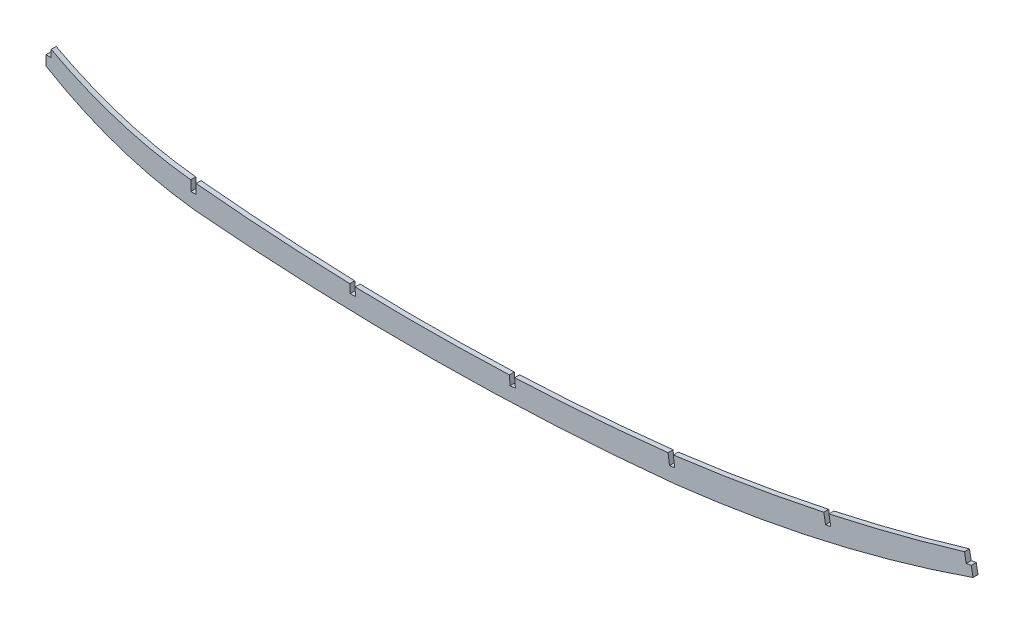
ISO-10303-21;
HEADER;
FILE_DESCRIPTION(('STEP AP214'),'2;1');
FILE_NAME('part.step','',(''),(''),'','','');
FILE_SCHEMA(('AUTOMOTIVE_DESIGN { 1 0 10303 214 1 1 1 1 }'));
ENDSEC;
DATA;
#1=APPLICATION_CONTEXT('core data for automotive mechanical design processes');
#2=APPLICATION_PROTOCOL_DEFINITION('international standard','automotive_design',2000,#1);
#3=PRODUCT_CONTEXT('',#1,'mechanical');
#4=PRODUCT('Part','Part','',(#3));
#5=PRODUCT_RELATED_PRODUCT_CATEGORY('part','',(#4));
#6=PRODUCT_DEFINITION_FORMATION('','',#4);
#7=PRODUCT_DEFINITION_CONTEXT('part definition',#1,'design');
#8=PRODUCT_DEFINITION('design','',#6,#7);
#9=PRODUCT_DEFINITION_SHAPE('','',#8);
#10=(LENGTH_UNIT() NAMED_UNIT(*) SI_UNIT(.MILLI.,.METRE.));
#11=(NAMED_UNIT(*) PLANE_ANGLE_UNIT() SI_UNIT($,.RADIAN.));
#12=(NAMED_UNIT(*) SI_UNIT($,.STERADIAN.) SOLID_ANGLE_UNIT());
#13=UNCERTAINTY_MEASURE_WITH_UNIT(LENGTH_MEASURE(1.E-05),#10,'distance_accuracy_value','');
#14=(GEOMETRIC_REPRESENTATION_CONTEXT(3) GLOBAL_UNCERTAINTY_ASSIGNED_CONTEXT((#13)) GLOBAL_UNIT_ASSIGNED_CONTEXT((#10,
#11,#12)) REPRESENTATION_CONTEXT('',''));
#15=CARTESIAN_POINT('',(0.,0.,0.));
#16=DIRECTION('',(0.,0.,1.));
#17=DIRECTION('',(1.,0.,0.));
#18=AXIS2_PLACEMENT_3D('',#15,#16,#17);
#19=CARTESIAN_POINT('',(254.672451197666,1031.92211819024,3.175));
#20=DIRECTION('',(0.,0.,-1.));
#21=DIRECTION('',(-1.,0.,0.));
#22=AXIS2_PLACEMENT_3D('',#19,#20,#21);
#23=CYLINDRICAL_SURFACE('',#22,1150.31332040319);
#24=DIRECTION('',(0.,0.,-1.));
#25=VECTOR('',#24,1.);
#26=CARTESIAN_POINT('',(495.714603883283,-92.8531552425034,3.175));
#27=LINE('',#26,#25);
#28=CARTESIAN_POINT('',(495.714603883283,-92.8531552425034,0.));
#29=VERTEX_POINT('',#28);
#30=CARTESIAN_POINT('',(495.714603883283,-92.8531552425034,3.175));
#31=VERTEX_POINT('',#30);
#32=EDGE_CURVE('E369',#29,#31,#27,.F.);
#33=ORIENTED_EDGE('',*,*,#32,.F.);
#34=CARTESIAN_POINT('',(254.672451197666,1031.92211819024,0.));
#35=DIRECTION('',(0.,0.,1.));
#36=DIRECTION('',(1.,0.,0.));
#37=AXIS2_PLACEMENT_3D('',#34,#35,#36);
#38=CIRCLE('',#37,1150.31332040319);
#39=CARTESIAN_POINT('',(399.839177363026,-109.194596572737,0.));
#40=VERTEX_POINT('',#39);
#41=EDGE_CURVE('E350',#40,#29,#38,.T.);
#42=ORIENTED_EDGE('',*,*,#41,.F.);
#43=DIRECTION('',(0.,0.,-1.));
#44=VECTOR('',#43,1.);
#45=CARTESIAN_POINT('',(399.839177363026,-109.194596572737,3.175));
#46=LINE('',#45,#44);
#47=CARTESIAN_POINT('',(399.839177363026,-109.194596572737,3.175));
#48=VERTEX_POINT('',#47);
#49=EDGE_CURVE('E367',#48,#40,#46,.T.);
#50=ORIENTED_EDGE('',*,*,#49,.F.);
#51=CARTESIAN_POINT('',(254.672451197666,1031.92211819024,3.175));
#52=DIRECTION('',(0.,0.,1.));
#53=DIRECTION('',(1.,0.,0.));
#54=AXIS2_PLACEMENT_3D('',#51,#52,#53);
#55=CIRCLE('',#54,1150.31332040319);
#56=EDGE_CURVE('E332',#48,#31,#55,.T.);
#57=ORIENTED_EDGE('',*,*,#56,.T.);
#58=EDGE_LOOP('',(#33,#42,#50,#57));
#59=FACE_BOUND('',#58,.T.);
#60=ADVANCED_FACE('F39',(#59),#23,.F.);
#61=CARTESIAN_POINT('',(237.35862434664,1321.37429175112,3.175));
#62=DIRECTION('',(0.,0.,-1.));
#63=DIRECTION('',(-1.,0.,0.));
#64=AXIS2_PLACEMENT_3D('',#61,#62,#63);
#65=CYLINDRICAL_SURFACE('',#64,1439.78857693711);
#66=DIRECTION('',(0.,0.,-1.));
#67=VECTOR('',#66,1.);
#68=CARTESIAN_POINT('',(95.6691,-111.425493623303,3.175));
#69=LINE('',#68,#67);
#70=CARTESIAN_POINT('',(95.6691,-111.425493623303,3.175));
#71=VERTEX_POINT('',#70);
#72=CARTESIAN_POINT('',(95.6691,-111.425493623303,0.));
#73=VERTEX_POINT('',#72);
#74=EDGE_CURVE('E317',#71,#73,#69,.T.);
#75=ORIENTED_EDGE('',*,*,#74,.F.);
#76=CARTESIAN_POINT('',(237.35862434664,1321.37429175112,3.175));
#77=DIRECTION('',(0.,0.,1.));
#78=DIRECTION('',(1.,0.,0.));
#79=AXIS2_PLACEMENT_3D('',#76,#77,#78);
#80=CIRCLE('',#79,1439.78857693711);
#81=CARTESIAN_POINT('',(193.623485077633,-117.749880748144,3.175));
#82=VERTEX_POINT('',#81);
#83=EDGE_CURVE('E316',#71,#82,#80,.T.);
#84=ORIENTED_EDGE('',*,*,#83,.T.);
#85=DIRECTION('',(0.,0.,-1.));
#86=VECTOR('',#85,1.);
#87=CARTESIAN_POINT('',(193.623485077633,-117.749880748144,3.175));
#88=LINE('',#87,#86);
#89=CARTESIAN_POINT('',(193.623485077633,-117.749880748144,0.));
#90=VERTEX_POINT('',#89);
#91=EDGE_CURVE('E307',#90,#82,#88,.F.);
#92=ORIENTED_EDGE('',*,*,#91,.F.);
#93=CARTESIAN_POINT('',(237.35862434664,1321.37429175112,0.));
#94=DIRECTION('',(0.,0.,1.));
#95=DIRECTION('',(1.,0.,0.));
#96=AXIS2_PLACEMENT_3D('',#93,#94,#95);
#97=CIRCLE('',#96,1439.78857693711);
#98=EDGE_CURVE('E263',#73,#90,#97,.T.);
#99=ORIENTED_EDGE('',*,*,#98,.F.);
#100=EDGE_LOOP('',(#75,#84,#92,#99));
#101=FACE_BOUND('',#100,.T.);
#102=ADVANCED_FACE('F314',(#101),#65,.F.);
#103=DIRECTION('',(0.,0.,-1.));
#104=VECTOR('',#103,1.);
#105=CARTESIAN_POINT('',(197.008785596879,-117.848775320638,3.175));
#106=LINE('',#105,#104);
#107=CARTESIAN_POINT('',(197.008785596879,-117.848775320638,3.175));
#108=VERTEX_POINT('',#107);
#109=CARTESIAN_POINT('',(197.008785596879,-117.848775320638,0.));
#110=VERTEX_POINT('',#109);
#111=EDGE_CURVE('E318',#108,#110,#106,.T.);
#112=ORIENTED_EDGE('',*,*,#111,.F.);
#113=CARTESIAN_POINT('',(295.327290668786,-117.24684670174,3.175));
#114=VERTEX_POINT('',#113);
#115=EDGE_CURVE('E336',#108,#114,#80,.T.);
#116=ORIENTED_EDGE('',*,*,#115,.T.);
#117=DIRECTION('',(0.,0.,-1.));
#118=VECTOR('',#117,1.);
#119=CARTESIAN_POINT('',(295.327290668786,-117.24684670174,3.175));
#120=LINE('',#119,#118);
#121=CARTESIAN_POINT('',(295.327290668786,-117.24684670174,0.));
#122=VERTEX_POINT('',#121);
#123=EDGE_CURVE('E322',#122,#114,#120,.F.);
#124=ORIENTED_EDGE('',*,*,#123,.F.);
#125=EDGE_CURVE('E353',#110,#122,#97,.T.);
#126=ORIENTED_EDGE('',*,*,#125,.F.);
#127=EDGE_LOOP('',(#112,#116,#124,#126));
#128=FACE_BOUND('',#127,.T.);
#129=ADVANCED_FACE('F400',(#128),#65,.F.);
#130=DIRECTION('',(0.,0.,-1.));
#131=VECTOR('',#130,1.);
#132=CARTESIAN_POINT('',(499.018474642178,-92.1400490958373,3.175));
#133=LINE('',#132,#131);
#134=CARTESIAN_POINT('',(499.018474642178,-92.1400490958373,3.175));
#135=VERTEX_POINT('',#134);
#136=CARTESIAN_POINT('',(499.018474642178,-92.1400490958373,0.));
#137=VERTEX_POINT('',#136);
#138=EDGE_CURVE('E373',#135,#137,#133,.T.);
#139=ORIENTED_EDGE('',*,*,#138,.F.);
#140=CARTESIAN_POINT('',(585.429283383532,-69.8131735470224,3.175));
#141=VERTEX_POINT('',#140);
#142=EDGE_CURVE('E273',#135,#141,#55,.T.);
#143=ORIENTED_EDGE('',*,*,#142,.T.);
#144=DIRECTION('',(0.,0.,-1.));
#145=VECTOR('',#144,1.);
#146=CARTESIAN_POINT('',(585.429283383532,-69.8131735470222,3.175));
#147=LINE('',#146,#145);
#148=CARTESIAN_POINT('',(585.429283383532,-69.8131735470224,0.));
#149=VERTEX_POINT('',#148);
#150=EDGE_CURVE('E376',#149,#141,#147,.F.);
#151=ORIENTED_EDGE('',*,*,#150,.F.);
#152=EDGE_CURVE('E329',#137,#149,#38,.T.);
#153=ORIENTED_EDGE('',*,*,#152,.F.);
#154=EDGE_LOOP('',(#139,#143,#151,#153));
#155=FACE_BOUND('',#154,.T.);
#156=ADVANCED_FACE('F41',(#155),#23,.F.);
#157=DIRECTION('',(0.,0.,-1.));
#158=VECTOR('',#157,1.);
#159=CARTESIAN_POINT('',(298.705922287425,-117.106731868565,3.175));
#160=LINE('',#159,#158);
#161=CARTESIAN_POINT('',(298.705922287425,-117.106731868565,3.175));
#162=VERTEX_POINT('',#161);
#163=CARTESIAN_POINT('',(298.705922287425,-117.106731868565,0.));
#164=VERTEX_POINT('',#163);
#165=EDGE_CURVE('E372',#162,#164,#160,.T.);
#166=ORIENTED_EDGE('',*,*,#165,.F.);
#167=CARTESIAN_POINT('',(396.484353389184,-109.593963883941,3.175));
#168=VERTEX_POINT('',#167);
#169=EDGE_CURVE('E333',#162,#168,#80,.T.);
#170=ORIENTED_EDGE('',*,*,#169,.T.);
#171=DIRECTION('',(0.,0.,-1.));
#172=VECTOR('',#171,1.);
#173=CARTESIAN_POINT('',(396.484353389184,-109.593963883941,3.175));
#174=LINE('',#173,#172);
#175=CARTESIAN_POINT('',(396.484353389184,-109.593963883941,0.));
#176=VERTEX_POINT('',#175);
#177=EDGE_CURVE('E468',#176,#168,#174,.F.);
#178=ORIENTED_EDGE('',*,*,#177,.F.);
#179=EDGE_CURVE('E351',#164,#176,#97,.T.);
#180=ORIENTED_EDGE('',*,*,#179,.F.);
#181=EDGE_LOOP('',(#166,#170,#178,#180));
#182=FACE_BOUND('',#181,.T.);
#183=ADVANCED_FACE('F507',(#182),#65,.F.);
#184=CARTESIAN_POINT('',(118.154365108344,130.291543645457,3.175));
#185=DIRECTION('',(0.,0.,-1.));
#186=DIRECTION('',(-1.,0.,0.));
#187=AXIS2_PLACEMENT_3D('',#184,#185,#186);
#188=CYLINDRICAL_SURFACE('',#187,242.755675026931);
#189=DIRECTION('',(0.,0.,-1.));
#190=VECTOR('',#189,1.);
#191=CARTESIAN_POINT('',(3.30200000000001,-83.5758264389031,3.175));
#192=LINE('',#191,#190);
#193=CARTESIAN_POINT('',(3.30200000000001,-83.5758264389031,3.175));
#194=VERTEX_POINT('',#193);
#195=CARTESIAN_POINT('',(3.30200000000001,-83.5758264389031,0.));
#196=VERTEX_POINT('',#195);
#197=EDGE_CURVE('E327',#194,#196,#192,.T.);
#198=ORIENTED_EDGE('',*,*,#197,.F.);
#199=CARTESIAN_POINT('',(118.154365108344,130.291543645457,3.175));
#200=DIRECTION('',(0.,0.,1.));
#201=DIRECTION('',(1.,0.,0.));
#202=AXIS2_PLACEMENT_3D('',#199,#200,#201);
#203=CIRCLE('',#202,242.755675026931);
#204=CARTESIAN_POINT('',(92.2909,-111.082437823902,3.175));
#205=VERTEX_POINT('',#204);
#206=EDGE_CURVE('E337',#194,#205,#203,.T.);
#207=ORIENTED_EDGE('',*,*,#206,.T.);
#208=DIRECTION('',(0.,0.,-1.));
#209=VECTOR('',#208,1.);
#210=CARTESIAN_POINT('',(92.2909,-111.082437823902,3.175));
#211=LINE('',#210,#209);
#212=CARTESIAN_POINT('',(92.2909,-111.082437823902,0.));
#213=VERTEX_POINT('',#212);
#214=EDGE_CURVE('E320',#213,#205,#211,.F.);
#215=ORIENTED_EDGE('',*,*,#214,.F.);
#216=CARTESIAN_POINT('',(118.154365108344,130.291543645457,0.));
#217=DIRECTION('',(0.,0.,1.));
#218=DIRECTION('',(1.,0.,0.));
#219=AXIS2_PLACEMENT_3D('',#216,#217,#218);
#220=CIRCLE('',#219,242.755675026931);
#221=EDGE_CURVE('E258',#196,#213,#220,.T.);
#222=ORIENTED_EDGE('',*,*,#221,.F.);
#223=EDGE_LOOP('',(#198,#207,#215,#222));
#224=FACE_BOUND('',#223,.T.);
#225=ADVANCED_FACE('F513',(#224),#188,.F.);
#226=CARTESIAN_POINT('',(0.,0.,3.175));
#227=DIRECTION('',(-1.,0.,0.));
#228=DIRECTION('',(0.,0.,1.));
#229=AXIS2_PLACEMENT_3D('',#226,#227,#228);
#230=PLANE('',#229);
#231=DIRECTION('',(0.,0.,1.));
#232=VECTOR('',#231,1.);
#233=CARTESIAN_POINT('',(0.,-88.1812715032451,0.));
#234=LINE('',#233,#232);
#235=CARTESIAN_POINT('',(0.,-88.1812715032451,0.));
#236=VERTEX_POINT('',#235);
#237=CARTESIAN_POINT('',(0.,-88.1812715032451,3.175));
#238=VERTEX_POINT('',#237);
#239=EDGE_CURVE('E239',#236,#238,#234,.T.);
#240=ORIENTED_EDGE('',*,*,#239,.F.);
#241=DIRECTION('',(0.,1.,0.));
#242=VECTOR('',#241,1.);
#243=CARTESIAN_POINT('',(0.,0.,0.));
#244=LINE('',#243,#242);
#245=CARTESIAN_POINT('',(0.,-94.4694470237963,0.));
#246=VERTEX_POINT('',#245);
#247=EDGE_CURVE('E250',#246,#236,#244,.T.);
#248=ORIENTED_EDGE('',*,*,#247,.F.);
#249=DIRECTION('',(0.,0.,-1.));
#250=VECTOR('',#249,1.);
#251=CARTESIAN_POINT('',(0.,-94.4694470237963,3.175));
#252=LINE('',#251,#250);
#253=CARTESIAN_POINT('',(0.,-94.4694470237963,3.175));
#254=VERTEX_POINT('',#253);
#255=EDGE_CURVE('E284',#254,#246,#252,.T.);
#256=ORIENTED_EDGE('',*,*,#255,.F.);
#257=DIRECTION('',(0.,1.,0.));
#258=VECTOR('',#257,1.);
#259=CARTESIAN_POINT('',(0.,0.,3.175));
#260=LINE('',#259,#258);
#261=EDGE_CURVE('E252',#254,#238,#260,.T.);
#262=ORIENTED_EDGE('',*,*,#261,.T.);
#263=EDGE_LOOP('',(#240,#248,#256,#262));
#264=FACE_BOUND('',#263,.T.);
#265=ADVANCED_FACE('F249',(#264),#230,.T.);
#266=CARTESIAN_POINT('',(121.734926149577,108.841104283008,3.175));
#267=DIRECTION('',(0.,0.,-1.));
#268=DIRECTION('',(-1.,0.,0.));
#269=AXIS2_PLACEMENT_3D('',#266,#267,#268);
#270=CYLINDRICAL_SURFACE('',#269,236.969560318028);
#271=CARTESIAN_POINT('',(121.734926149577,108.841104283008,0.));
#272=DIRECTION('',(0.,0.,1.));
#273=DIRECTION('',(1.,0.,0.));
#274=AXIS2_PLACEMENT_3D('',#271,#272,#273);
#275=CIRCLE('',#274,236.969560318028);
#276=CARTESIAN_POINT('',(93.9800000000004,-126.497453101351,0.));
#277=VERTEX_POINT('',#276);
#278=EDGE_CURVE('E257',#246,#277,#275,.T.);
#279=ORIENTED_EDGE('',*,*,#278,.T.);
#280=DIRECTION('',(0.,0.,-1.));
#281=VECTOR('',#280,1.);
#282=CARTESIAN_POINT('',(93.9800000000004,-126.497453101351,3.175));
#283=LINE('',#282,#281);
#284=CARTESIAN_POINT('',(93.9800000000004,-126.497453101351,3.175));
#285=VERTEX_POINT('',#284);
#286=EDGE_CURVE('E281',#285,#277,#283,.T.);
#287=ORIENTED_EDGE('',*,*,#286,.F.);
#288=CARTESIAN_POINT('',(121.734926149577,108.841104283008,3.175));
#289=DIRECTION('',(0.,0.,1.));
#290=DIRECTION('',(1.,0.,0.));
#291=AXIS2_PLACEMENT_3D('',#288,#289,#290);
#292=CIRCLE('',#291,236.969560318028);
#293=EDGE_CURVE('E341',#254,#285,#292,.T.);
#294=ORIENTED_EDGE('',*,*,#293,.F.);
#295=ORIENTED_EDGE('',*,*,#255,.T.);
#296=EDGE_LOOP('',(#279,#287,#294,#295));
#297=FACE_BOUND('',#296,.T.);
#298=ADVANCED_FACE('F523',(#297),#270,.T.);
#299=CARTESIAN_POINT('',(237.971630213688,1487.12434573409,3.175));
#300=DIRECTION('',(0.,0.,-1.));
#301=DIRECTION('',(-1.,0.,0.));
#302=AXIS2_PLACEMENT_3D('',#299,#300,#301);
#303=CYLINDRICAL_SURFACE('',#302,1620.03361053051);
#304=CARTESIAN_POINT('',(237.971630213688,1487.12434573409,0.));
#305=DIRECTION('',(0.,0.,1.));
#306=DIRECTION('',(1.,0.,0.));
#307=AXIS2_PLACEMENT_3D('',#304,#305,#306);
#308=CIRCLE('',#307,1620.03361053051);
#309=CARTESIAN_POINT('',(400.203586986722,-124.765753326672,0.));
#310=VERTEX_POINT('',#309);
#311=EDGE_CURVE('E260',#277,#310,#308,.T.);
#312=ORIENTED_EDGE('',*,*,#311,.T.);
#313=DIRECTION('',(0.,0.,-1.));
#314=VECTOR('',#313,1.);
#315=CARTESIAN_POINT('',(400.203586986722,-124.765753326672,3.175));
#316=LINE('',#315,#314);
#317=CARTESIAN_POINT('',(400.203586986722,-124.765753326672,3.175));
#318=VERTEX_POINT('',#317);
#319=EDGE_CURVE('E277',#318,#310,#316,.T.);
#320=ORIENTED_EDGE('',*,*,#319,.F.);
#321=CARTESIAN_POINT('',(237.971630213688,1487.12434573409,3.175));
#322=DIRECTION('',(0.,0.,1.));
#323=DIRECTION('',(1.,0.,0.));
#324=AXIS2_PLACEMENT_3D('',#321,#322,#323);
#325=CIRCLE('',#324,1620.03361053051);
#326=EDGE_CURVE('E343',#285,#318,#325,.T.);
#327=ORIENTED_EDGE('',*,*,#326,.F.);
#328=ORIENTED_EDGE('',*,*,#286,.T.);
#329=EDGE_LOOP('',(#312,#320,#327,#328));
#330=FACE_BOUND('',#329,.T.);
#331=ADVANCED_FACE('F526',(#330),#303,.T.);
#332=CARTESIAN_POINT('',(300.498350227972,753.512922358262,3.175));
#333=DIRECTION('',(0.,0.,-1.));
#334=DIRECTION('',(-1.,0.,0.));
#335=AXIS2_PLACEMENT_3D('',#332,#333,#334);
#336=CYLINDRICAL_SURFACE('',#335,883.92);
#337=CARTESIAN_POINT('',(300.498350227972,753.512922358262,0.));
#338=DIRECTION('',(0.,0.,1.));
#339=DIRECTION('',(1.,0.,0.));
#340=AXIS2_PLACEMENT_3D('',#337,#338,#339);
#341=CIRCLE('',#340,883.92);
#342=CARTESIAN_POINT('',(590.864339182333,-81.3536291687202,0.));
#343=VERTEX_POINT('',#342);
#344=EDGE_CURVE('E268',#310,#343,#341,.T.);
#345=ORIENTED_EDGE('',*,*,#344,.T.);
#346=DIRECTION('',(0.,0.,-1.));
#347=VECTOR('',#346,1.);
#348=CARTESIAN_POINT('',(590.864339182333,-81.3536291687202,3.175));
#349=LINE('',#348,#347);
#350=CARTESIAN_POINT('',(590.864339182333,-81.3536291687202,3.175));
#351=VERTEX_POINT('',#350);
#352=EDGE_CURVE('E274',#351,#343,#349,.T.);
#353=ORIENTED_EDGE('',*,*,#352,.F.);
#354=CARTESIAN_POINT('',(300.498350227972,753.512922358262,3.175));
#355=DIRECTION('',(0.,0.,1.));
#356=DIRECTION('',(1.,0.,0.));
#357=AXIS2_PLACEMENT_3D('',#354,#355,#356);
#358=CIRCLE('',#357,883.92);
#359=EDGE_CURVE('E345',#318,#351,#358,.T.);
#360=ORIENTED_EDGE('',*,*,#359,.F.);
#361=ORIENTED_EDGE('',*,*,#319,.T.);
#362=EDGE_LOOP('',(#345,#353,#360,#361));
#363=FACE_BOUND('',#362,.T.);
#364=ADVANCED_FACE('F530',(#363),#336,.T.);
#365=CARTESIAN_POINT('',(557.656434856401,101.355592915415,3.175));
#366=DIRECTION('',(-0.983881237780973,-0.178823124742247,0.));
#367=DIRECTION('',(0.178823124742247,-0.983881237780973,0.));
#368=AXIS2_PLACEMENT_3D('',#365,#366,#367);
#369=PLANE('',#368);
#370=DIRECTION('',(-0.178823124742247,0.983881237780973,0.));
#371=VECTOR('',#370,1.);
#372=CARTESIAN_POINT('',(557.656434856401,101.355592915415,0.));
#373=LINE('',#372,#371);
#374=CARTESIAN_POINT('',(589.742350018123,-75.1804673405135,0.));
#375=VERTEX_POINT('',#374);
#376=EDGE_CURVE('E270',#343,#375,#373,.T.);
#377=ORIENTED_EDGE('',*,*,#376,.T.);
#378=DIRECTION('',(0.,0.,1.));
#379=VECTOR('',#378,1.);
#380=CARTESIAN_POINT('',(589.742350018123,-75.1804673405136,3.175));
#381=LINE('',#380,#379);
#382=CARTESIAN_POINT('',(589.742350018123,-75.1804673405136,3.175));
#383=VERTEX_POINT('',#382);
#384=EDGE_CURVE('E470',#375,#383,#381,.T.);
#385=ORIENTED_EDGE('',*,*,#384,.T.);
#386=DIRECTION('',(-0.178823124742247,0.983881237780973,0.));
#387=VECTOR('',#386,1.);
#388=CARTESIAN_POINT('',(557.656434856401,101.355592915415,3.175));
#389=LINE('',#388,#387);
#390=EDGE_CURVE('E278',#351,#383,#389,.T.);
#391=ORIENTED_EDGE('',*,*,#390,.F.);
#392=ORIENTED_EDGE('',*,*,#352,.T.);
#393=EDGE_LOOP('',(#377,#385,#391,#392));
#394=FACE_BOUND('',#393,.T.);
#395=ADVANCED_FACE('F534',(#394),#369,.F.);
#396=CARTESIAN_POINT('',(0.,0.,3.175));
#397=DIRECTION('',(0.,0.,1.));
#398=DIRECTION('',(1.,0.,0.));
#399=AXIS2_PLACEMENT_3D('',#396,#397,#398);
#400=PLANE('',#399);
#401=DIRECTION('',(0.,1.,0.));
#402=VECTOR('',#401,1.);
#403=CARTESIAN_POINT('',(3.30200000000001,-80.8492532430665,3.175));
#404=LINE('',#403,#402);
#405=CARTESIAN_POINT('',(3.30200000000001,-88.1812715032451,3.175));
#406=VERTEX_POINT('',#405);
#407=EDGE_CURVE('E244',#406,#194,#404,.T.);
#408=ORIENTED_EDGE('',*,*,#407,.F.);
#409=DIRECTION('',(1.,0.,0.));
#410=VECTOR('',#409,1.);
#411=CARTESIAN_POINT('',(0.,-88.1812715032451,3.175));
#412=LINE('',#411,#410);
#413=EDGE_CURVE('E615',#238,#406,#412,.T.);
#414=ORIENTED_EDGE('',*,*,#413,.F.);
#415=ORIENTED_EDGE('',*,*,#261,.F.);
#416=ORIENTED_EDGE('',*,*,#293,.T.);
#417=ORIENTED_EDGE('',*,*,#326,.T.);
#418=ORIENTED_EDGE('',*,*,#359,.T.);
#419=ORIENTED_EDGE('',*,*,#390,.T.);
#420=DIRECTION('',(0.983777385928307,0.179393575515032,0.));
#421=VECTOR('',#420,1.);
#422=CARTESIAN_POINT('',(586.515324681227,-75.7689212140668,3.175));
#423=LINE('',#422,#421);
#424=CARTESIAN_POINT('',(586.515324681227,-75.7689212140668,3.175));
#425=VERTEX_POINT('',#424);
#426=EDGE_CURVE('E462',#425,#383,#423,.T.);
#427=ORIENTED_EDGE('',*,*,#426,.F.);
#428=DIRECTION('',(0.179393575515032,-0.983777385928307,0.));
#429=VECTOR('',#428,1.);
#430=CARTESIAN_POINT('',(586.515324681227,-75.7689212140668,3.175));
#431=LINE('',#430,#429);
#432=EDGE_CURVE('E449',#141,#425,#431,.T.);
#433=ORIENTED_EDGE('',*,*,#432,.F.);
#434=ORIENTED_EDGE('',*,*,#142,.F.);
#435=DIRECTION('',(-0.179393575490294,0.983777385932818,0.));
#436=VECTOR('',#435,1.);
#437=CARTESIAN_POINT('',(500.199190721791,-98.6149843055094,3.175));
#438=LINE('',#437,#436);
#439=CARTESIAN_POINT('',(500.199190721791,-98.6149843055094,3.175));
#440=VERTEX_POINT('',#439);
#441=EDGE_CURVE('E432',#440,#135,#438,.T.);
#442=ORIENTED_EDGE('',*,*,#441,.F.);
#443=DIRECTION('',(0.983777385932816,0.179393575490302,0.));
#444=VECTOR('',#443,1.);
#445=CARTESIAN_POINT('',(496.875793956633,-99.2210116822308,3.175));
#446=LINE('',#445,#444);
#447=CARTESIAN_POINT('',(496.875793956633,-99.2210116822308,3.175));
#448=VERTEX_POINT('',#447);
#449=EDGE_CURVE('E434',#448,#440,#446,.T.);
#450=ORIENTED_EDGE('',*,*,#449,.F.);
#451=DIRECTION('',(0.179393575490301,-0.983777385932816,0.));
#452=VECTOR('',#451,1.);
#453=CARTESIAN_POINT('',(496.875793956633,-99.2210116822308,3.175));
#454=LINE('',#453,#452);
#455=EDGE_CURVE('E438',#31,#448,#454,.T.);
#456=ORIENTED_EDGE('',*,*,#455,.F.);
#457=ORIENTED_EDGE('',*,*,#56,.F.);
#458=DIRECTION('',(-0.131675290135219,0.991292902207922,0.));
#459=VECTOR('',#458,1.);
#460=CARTESIAN_POINT('',(400.723885221412,-115.854954940995,3.175));
#461=LINE('',#460,#459);
#462=CARTESIAN_POINT('',(400.723885221412,-115.854954940995,3.175));
#463=VERTEX_POINT('',#462);
#464=EDGE_CURVE('E450',#463,#48,#461,.T.);
#465=ORIENTED_EDGE('',*,*,#464,.F.);
#466=DIRECTION('',(0.991292902207923,0.131675290135217,0.));
#467=VECTOR('',#466,1.);
#468=CARTESIAN_POINT('',(397.375099539173,-116.29978040613,3.175));
#469=LINE('',#468,#467);
#470=CARTESIAN_POINT('',(397.375099539173,-116.29978040613,3.175));
#471=VERTEX_POINT('',#470);
#472=EDGE_CURVE('E452',#471,#463,#469,.T.);
#473=ORIENTED_EDGE('',*,*,#472,.F.);
#474=DIRECTION('',(0.13167529013522,-0.991292902207922,0.));
#475=VECTOR('',#474,1.);
#476=CARTESIAN_POINT('',(397.375099539173,-116.29978040613,3.175));
#477=LINE('',#476,#475);
#478=EDGE_CURVE('E418',#168,#471,#477,.T.);
#479=ORIENTED_EDGE('',*,*,#478,.F.);
#480=ORIENTED_EDGE('',*,*,#169,.F.);
#481=DIRECTION('',(-0.0857626230360208,0.996315598839033,0.));
#482=VECTOR('',#481,1.);
#483=CARTESIAN_POINT('',(299.18903405841,-122.719104442721,3.175));
#484=LINE('',#483,#482);
#485=CARTESIAN_POINT('',(299.18903405841,-122.719104442721,3.175));
#486=VERTEX_POINT('',#485);
#487=EDGE_CURVE('E419',#486,#162,#484,.T.);
#488=ORIENTED_EDGE('',*,*,#487,.F.);
#489=DIRECTION('',(0.996315598839034,0.0857626230360193,0.));
#490=VECTOR('',#489,1.);
#491=CARTESIAN_POINT('',(295.823280702412,-123.008827735861,3.175));
#492=LINE('',#491,#490);
#493=CARTESIAN_POINT('',(295.823280702412,-123.008827735861,3.175));
#494=VERTEX_POINT('',#493);
#495=EDGE_CURVE('E396',#494,#486,#492,.T.);
#496=ORIENTED_EDGE('',*,*,#495,.F.);
#497=DIRECTION('',(0.085762623036021,-0.996315598839033,0.));
#498=VECTOR('',#497,1.);
#499=CARTESIAN_POINT('',(295.823280702412,-123.008827735861,3.175));
#500=LINE('',#499,#498);
#501=EDGE_CURVE('E383',#114,#494,#500,.T.);
#502=ORIENTED_EDGE('',*,*,#501,.F.);
#503=ORIENTED_EDGE('',*,*,#115,.F.);
#504=DIRECTION('',(-0.0418331153502416,0.99912461207804,0.));
#505=VECTOR('',#504,1.);
#506=CARTESIAN_POINT('',(197.224876239004,-123.009793742993,3.175));
#507=LINE('',#506,#505);
#508=CARTESIAN_POINT('',(197.224876239004,-123.009793742993,3.175));
#509=VERTEX_POINT('',#508);
#510=EDGE_CURVE('E405',#509,#108,#507,.T.);
#511=ORIENTED_EDGE('',*,*,#510,.F.);
#512=DIRECTION('',(0.99912461207804,0.0418331153502432,0.));
#513=VECTOR('',#512,1.);
#514=CARTESIAN_POINT('',(193.849633474482,-123.151114373269,3.175));
#515=LINE('',#514,#513);
#516=CARTESIAN_POINT('',(193.849633474482,-123.151114373269,3.175));
#517=VERTEX_POINT('',#516);
#518=EDGE_CURVE('E603',#517,#509,#515,.T.);
#519=ORIENTED_EDGE('',*,*,#518,.F.);
#520=DIRECTION('',(0.0418331153502455,-0.99912461207804,0.));
#521=VECTOR('',#520,1.);
#522=CARTESIAN_POINT('',(193.849633474482,-123.151114373269,3.175));
#523=LINE('',#522,#521);
#524=EDGE_CURVE('E410',#82,#517,#523,.T.);
#525=ORIENTED_EDGE('',*,*,#524,.F.);
#526=ORIENTED_EDGE('',*,*,#83,.F.);
#527=DIRECTION('',(0.,1.,0.));
#528=VECTOR('',#527,1.);
#529=CARTESIAN_POINT('',(95.6691,-117.531253116271,3.175));
#530=LINE('',#529,#528);
#531=CARTESIAN_POINT('',(95.6691,-117.531253116271,3.175));
#532=VERTEX_POINT('',#531);
#533=EDGE_CURVE('E610',#532,#71,#530,.T.);
#534=ORIENTED_EDGE('',*,*,#533,.F.);
#535=DIRECTION('',(1.,0.,0.));
#536=VECTOR('',#535,1.);
#537=CARTESIAN_POINT('',(92.2909,-117.531253116271,3.175));
#538=LINE('',#537,#536);
#539=CARTESIAN_POINT('',(92.2909,-117.531253116271,3.175));
#540=VERTEX_POINT('',#539);
#541=EDGE_CURVE('E616',#540,#532,#538,.T.);
#542=ORIENTED_EDGE('',*,*,#541,.F.);
#543=DIRECTION('',(0.,-1.,0.));
#544=VECTOR('',#543,1.);
#545=CARTESIAN_POINT('',(92.2909,-117.531253116271,3.175));
#546=LINE('',#545,#544);
#547=EDGE_CURVE('E613',#205,#540,#546,.T.);
#548=ORIENTED_EDGE('',*,*,#547,.F.);
#549=ORIENTED_EDGE('',*,*,#206,.F.);
#550=EDGE_LOOP('',(#408,#414,#415,#416,#417,#418,#419,#427,#433,#434,#442,#450,#456,#457,#465,
#473,#479,#480,#488,#496,#502,#503,#511,#519,#525,#526,#534,#542,#548,#549));
#551=FACE_BOUND('',#550,.T.);
#552=ADVANCED_FACE('F392',(#551),#400,.T.);
#553=CARTESIAN_POINT('',(0.,0.,0.));
#554=DIRECTION('',(0.,0.,1.));
#555=DIRECTION('',(1.,0.,0.));
#556=AXIS2_PLACEMENT_3D('',#553,#554,#555);
#557=PLANE('',#556);
#558=DIRECTION('',(1.,0.,0.));
#559=VECTOR('',#558,1.);
#560=CARTESIAN_POINT('',(0.,-88.1812715032451,0.));
#561=LINE('',#560,#559);
#562=CARTESIAN_POINT('',(3.30200000000001,-88.1812715032451,0.));
#563=VERTEX_POINT('',#562);
#564=EDGE_CURVE('E235',#236,#563,#561,.T.);
#565=ORIENTED_EDGE('',*,*,#564,.T.);
#566=DIRECTION('',(0.,1.,0.));
#567=VECTOR('',#566,1.);
#568=CARTESIAN_POINT('',(3.30200000000001,-81.8236515032451,0.));
#569=LINE('',#568,#567);
#570=EDGE_CURVE('E54',#563,#196,#569,.T.);
#571=ORIENTED_EDGE('',*,*,#570,.T.);
#572=ORIENTED_EDGE('',*,*,#221,.T.);
#573=DIRECTION('',(0.,-1.,0.));
#574=VECTOR('',#573,1.);
#575=CARTESIAN_POINT('',(92.2909,0.,0.));
#576=LINE('',#575,#574);
#577=CARTESIAN_POINT('',(92.2909,-117.531253116271,0.));
#578=VERTEX_POINT('',#577);
#579=EDGE_CURVE('E11',#213,#578,#576,.T.);
#580=ORIENTED_EDGE('',*,*,#579,.T.);
#581=DIRECTION('',(1.,0.,0.));
#582=VECTOR('',#581,1.);
#583=CARTESIAN_POINT('',(92.2909,-117.531253116271,0.));
#584=LINE('',#583,#582);
#585=CARTESIAN_POINT('',(95.6691,-117.531253116271,0.));
#586=VERTEX_POINT('',#585);
#587=EDGE_CURVE('E607',#578,#586,#584,.T.);
#588=ORIENTED_EDGE('',*,*,#587,.T.);
#589=DIRECTION('',(0.,1.,0.));
#590=VECTOR('',#589,1.);
#591=CARTESIAN_POINT('',(95.6691,-117.531253116271,0.));
#592=LINE('',#591,#590);
#593=EDGE_CURVE('E62',#586,#73,#592,.T.);
#594=ORIENTED_EDGE('',*,*,#593,.T.);
#595=ORIENTED_EDGE('',*,*,#98,.T.);
#596=DIRECTION('',(0.0418331153502455,-0.99912461207804,0.));
#597=VECTOR('',#596,1.);
#598=CARTESIAN_POINT('',(188.363109812427,7.88671963963063,0.));
#599=LINE('',#598,#597);
#600=CARTESIAN_POINT('',(193.849633474482,-123.151114373269,0.));
#601=VERTEX_POINT('',#600);
#602=EDGE_CURVE('E47',#90,#601,#599,.T.);
#603=ORIENTED_EDGE('',*,*,#602,.T.);
#604=DIRECTION('',(0.99912461207804,0.0418331153502432,0.));
#605=VECTOR('',#604,1.);
#606=CARTESIAN_POINT('',(193.849633474482,-123.151114373269,0.));
#607=LINE('',#606,#605);
#608=CARTESIAN_POINT('',(197.224876239004,-123.009793742993,0.));
#609=VERTEX_POINT('',#608);
#610=EDGE_CURVE('E302',#601,#609,#607,.T.);
#611=ORIENTED_EDGE('',*,*,#610,.T.);
#612=DIRECTION('',(-0.0418331153502416,0.99912461207804,0.));
#613=VECTOR('',#612,1.);
#614=CARTESIAN_POINT('',(197.224876239004,-123.009793742993,0.));
#615=LINE('',#614,#613);
#616=EDGE_CURVE('E403',#609,#110,#615,.T.);
#617=ORIENTED_EDGE('',*,*,#616,.T.);
#618=ORIENTED_EDGE('',*,*,#125,.T.);
#619=DIRECTION('',(0.085762623036021,-0.996315598839033,0.));
#620=VECTOR('',#619,1.);
#621=CARTESIAN_POINT('',(283.136742256964,24.3723471981433,0.));
#622=LINE('',#621,#620);
#623=CARTESIAN_POINT('',(295.823280702412,-123.008827735861,0.));
#624=VERTEX_POINT('',#623);
#625=EDGE_CURVE('E295',#122,#624,#622,.T.);
#626=ORIENTED_EDGE('',*,*,#625,.T.);
#627=DIRECTION('',(0.996315598839034,0.0857626230360193,0.));
#628=VECTOR('',#627,1.);
#629=CARTESIAN_POINT('',(295.823280702412,-123.008827735861,0.));
#630=LINE('',#629,#628);
#631=CARTESIAN_POINT('',(299.18903405841,-122.719104442721,0.));
#632=VERTEX_POINT('',#631);
#633=EDGE_CURVE('E421',#624,#632,#630,.T.);
#634=ORIENTED_EDGE('',*,*,#633,.T.);
#635=DIRECTION('',(-0.0857626230360208,0.996315598839033,0.));
#636=VECTOR('',#635,1.);
#637=CARTESIAN_POINT('',(299.18903405841,-122.719104442721,0.));
#638=LINE('',#637,#636);
#639=EDGE_CURVE('E415',#632,#164,#638,.T.);
#640=ORIENTED_EDGE('',*,*,#639,.T.);
#641=ORIENTED_EDGE('',*,*,#179,.T.);
#642=DIRECTION('',(0.13167529013522,-0.991292902207923,0.));
#643=VECTOR('',#642,1.);
#644=CARTESIAN_POINT('',(375.304789743613,49.8524371238385,0.));
#645=LINE('',#644,#643);
#646=CARTESIAN_POINT('',(397.375099539173,-116.29978040613,0.));
#647=VERTEX_POINT('',#646);
#648=EDGE_CURVE('E286',#176,#647,#645,.T.);
#649=ORIENTED_EDGE('',*,*,#648,.T.);
#650=DIRECTION('',(0.991292902207923,0.131675290135217,0.));
#651=VECTOR('',#650,1.);
#652=CARTESIAN_POINT('',(397.375099539173,-116.29978040613,0.));
#653=LINE('',#652,#651);
#654=CARTESIAN_POINT('',(400.723885221412,-115.854954940995,0.));
#655=VERTEX_POINT('',#654);
#656=EDGE_CURVE('E453',#647,#655,#653,.T.);
#657=ORIENTED_EDGE('',*,*,#656,.T.);
#658=DIRECTION('',(-0.131675290135219,0.991292902207922,0.));
#659=VECTOR('',#658,1.);
#660=CARTESIAN_POINT('',(400.723885221412,-115.854954940995,0.));
#661=LINE('',#660,#659);
#662=EDGE_CURVE('E362',#655,#40,#661,.T.);
#663=ORIENTED_EDGE('',*,*,#662,.T.);
#664=ORIENTED_EDGE('',*,*,#41,.T.);
#665=DIRECTION('',(0.179393575490301,-0.983777385932816,0.));
#666=VECTOR('',#665,1.);
#667=CARTESIAN_POINT('',(463.374454050911,84.4971650006354,0.));
#668=LINE('',#667,#666);
#669=CARTESIAN_POINT('',(496.875793956633,-99.2210116822308,0.));
#670=VERTEX_POINT('',#669);
#671=EDGE_CURVE('E292',#29,#670,#668,.T.);
#672=ORIENTED_EDGE('',*,*,#671,.T.);
#673=DIRECTION('',(0.983777385932816,0.179393575490302,0.));
#674=VECTOR('',#673,1.);
#675=CARTESIAN_POINT('',(496.875793956633,-99.2210116822308,0.));
#676=LINE('',#675,#674);
#677=CARTESIAN_POINT('',(500.199190721791,-98.6149843055094,0.));
#678=VERTEX_POINT('',#677);
#679=EDGE_CURVE('E435',#670,#678,#676,.T.);
#680=ORIENTED_EDGE('',*,*,#679,.T.);
#681=DIRECTION('',(-0.179393575490294,0.983777385932818,0.));
#682=VECTOR('',#681,1.);
#683=CARTESIAN_POINT('',(500.199190721791,-98.6149843055094,0.));
#684=LINE('',#683,#682);
#685=EDGE_CURVE('E429',#678,#137,#684,.T.);
#686=ORIENTED_EDGE('',*,*,#685,.T.);
#687=ORIENTED_EDGE('',*,*,#152,.T.);
#688=DIRECTION('',(0.179393575515032,-0.983777385928307,0.));
#689=VECTOR('',#688,1.);
#690=CARTESIAN_POINT('',(554.268103787364,101.071785502089,0.));
#691=LINE('',#690,#689);
#692=CARTESIAN_POINT('',(586.515324681227,-75.7689212140668,0.));
#693=VERTEX_POINT('',#692);
#694=EDGE_CURVE('E289',#149,#693,#691,.T.);
#695=ORIENTED_EDGE('',*,*,#694,.T.);
#696=DIRECTION('',(0.983777385928307,0.179393575515032,0.));
#697=VECTOR('',#696,1.);
#698=CARTESIAN_POINT('',(586.515324681227,-75.7689212140668,0.));
#699=LINE('',#698,#697);
#700=EDGE_CURVE('E461',#693,#375,#699,.T.);
#701=ORIENTED_EDGE('',*,*,#700,.T.);
#702=ORIENTED_EDGE('',*,*,#376,.F.);
#703=ORIENTED_EDGE('',*,*,#344,.F.);
#704=ORIENTED_EDGE('',*,*,#311,.F.);
#705=ORIENTED_EDGE('',*,*,#278,.F.);
#706=ORIENTED_EDGE('',*,*,#247,.T.);
#707=EDGE_LOOP('',(#565,#571,#572,#580,#588,#594,#595,#603,#611,#617,#618,#626,#634,#640,#641,
#649,#657,#663,#664,#672,#680,#686,#687,#695,#701,#702,#703,#704,#705,#706));
#708=FACE_BOUND('',#707,.T.);
#709=ADVANCED_FACE('F255',(#708),#557,.F.);
#710=CARTESIAN_POINT('',(397.375099539173,-116.29978040613,0.));
#711=DIRECTION('',(-0.991292902207923,-0.13167529013522,0.));
#712=DIRECTION('',(0.13167529013522,-0.991292902207923,0.));
#713=AXIS2_PLACEMENT_3D('',#710,#711,#712);
#714=PLANE('',#713);
#715=ORIENTED_EDGE('',*,*,#177,.T.);
#716=ORIENTED_EDGE('',*,*,#478,.T.);
#717=DIRECTION('',(0.,0.,1.));
#718=VECTOR('',#717,1.);
#719=CARTESIAN_POINT('',(397.375099539173,-116.29978040613,0.));
#720=LINE('',#719,#718);
#721=EDGE_CURVE('E444',#647,#471,#720,.T.);
#722=ORIENTED_EDGE('',*,*,#721,.F.);
#723=ORIENTED_EDGE('',*,*,#648,.F.);
#724=EDGE_LOOP('',(#715,#716,#722,#723));
#725=FACE_BOUND('',#724,.T.);
#726=ADVANCED_FACE('F541',(#725),#714,.F.);
#727=CARTESIAN_POINT('',(400.723885221412,-115.854954940995,0.));
#728=DIRECTION('',(0.991292902207923,0.131675290135219,0.));
#729=DIRECTION('',(-0.131675290135219,0.991292902207923,0.));
#730=AXIS2_PLACEMENT_3D('',#727,#728,#729);
#731=PLANE('',#730);
#732=ORIENTED_EDGE('',*,*,#49,.T.);
#733=ORIENTED_EDGE('',*,*,#662,.F.);
#734=DIRECTION('',(0.,0.,1.));
#735=VECTOR('',#734,1.);
#736=CARTESIAN_POINT('',(400.723885221412,-115.854954940995,0.));
#737=LINE('',#736,#735);
#738=EDGE_CURVE('E447',#655,#463,#737,.T.);
#739=ORIENTED_EDGE('',*,*,#738,.T.);
#740=ORIENTED_EDGE('',*,*,#464,.T.);
#741=EDGE_LOOP('',(#732,#733,#739,#740));
#742=FACE_BOUND('',#741,.T.);
#743=ADVANCED_FACE('F548',(#742),#731,.F.);
#744=CARTESIAN_POINT('',(397.375099539173,-116.29978040613,0.));
#745=DIRECTION('',(0.131675290135217,-0.991292902207923,0.));
#746=DIRECTION('',(0.991292902207923,0.131675290135217,0.));
#747=AXIS2_PLACEMENT_3D('',#744,#745,#746);
#748=PLANE('',#747);
#749=ORIENTED_EDGE('',*,*,#472,.T.);
#750=ORIENTED_EDGE('',*,*,#738,.F.);
#751=ORIENTED_EDGE('',*,*,#656,.F.);
#752=ORIENTED_EDGE('',*,*,#721,.T.);
#753=EDGE_LOOP('',(#749,#750,#751,#752));
#754=FACE_BOUND('',#753,.T.);
#755=ADVANCED_FACE('F545',(#754),#748,.F.);
#756=CARTESIAN_POINT('',(586.515324681227,-75.7689212140668,0.));
#757=DIRECTION('',(0.179393575515032,-0.983777385928307,0.));
#758=DIRECTION('',(0.983777385928307,0.179393575515032,0.));
#759=AXIS2_PLACEMENT_3D('',#756,#757,#758);
#760=PLANE('',#759);
#761=ORIENTED_EDGE('',*,*,#700,.F.);
#762=DIRECTION('',(0.,0.,1.));
#763=VECTOR('',#762,1.);
#764=CARTESIAN_POINT('',(586.515324681227,-75.7689212140668,0.));
#765=LINE('',#764,#763);
#766=EDGE_CURVE('E440',#693,#425,#765,.T.);
#767=ORIENTED_EDGE('',*,*,#766,.T.);
#768=ORIENTED_EDGE('',*,*,#426,.T.);
#769=ORIENTED_EDGE('',*,*,#384,.F.);
#770=EDGE_LOOP('',(#761,#767,#768,#769));
#771=FACE_BOUND('',#770,.T.);
#772=ADVANCED_FACE('F498',(#771),#760,.F.);
#773=CARTESIAN_POINT('',(586.515324681227,-75.7689212140668,0.));
#774=DIRECTION('',(-0.983777385928307,-0.179393575515032,0.));
#775=DIRECTION('',(0.179393575515032,-0.983777385928307,0.));
#776=AXIS2_PLACEMENT_3D('',#773,#774,#775);
#777=PLANE('',#776);
#778=ORIENTED_EDGE('',*,*,#150,.T.);
#779=ORIENTED_EDGE('',*,*,#432,.T.);
#780=ORIENTED_EDGE('',*,*,#766,.F.);
#781=ORIENTED_EDGE('',*,*,#694,.F.);
#782=EDGE_LOOP('',(#778,#779,#780,#781));
#783=FACE_BOUND('',#782,.T.);
#784=ADVANCED_FACE('F475',(#783),#777,.F.);
#785=CARTESIAN_POINT('',(496.875793956633,-99.2210116822308,0.));
#786=DIRECTION('',(-0.983777385932816,-0.179393575490301,0.));
#787=DIRECTION('',(0.179393575490301,-0.983777385932816,0.));
#788=AXIS2_PLACEMENT_3D('',#785,#786,#787);
#789=PLANE('',#788);
#790=ORIENTED_EDGE('',*,*,#32,.T.);
#791=ORIENTED_EDGE('',*,*,#455,.T.);
#792=DIRECTION('',(0.,0.,1.));
#793=VECTOR('',#792,1.);
#794=CARTESIAN_POINT('',(496.875793956633,-99.2210116822308,0.));
#795=LINE('',#794,#793);
#796=EDGE_CURVE('E426',#670,#448,#795,.T.);
#797=ORIENTED_EDGE('',*,*,#796,.F.);
#798=ORIENTED_EDGE('',*,*,#671,.F.);
#799=EDGE_LOOP('',(#790,#791,#797,#798));
#800=FACE_BOUND('',#799,.T.);
#801=ADVANCED_FACE('F490',(#800),#789,.F.);
#802=CARTESIAN_POINT('',(500.199190721791,-98.6149843055094,0.));
#803=DIRECTION('',(0.983777385932818,0.179393575490294,0.));
#804=DIRECTION('',(-0.179393575490294,0.983777385932818,0.));
#805=AXIS2_PLACEMENT_3D('',#802,#803,#804);
#806=PLANE('',#805);
#807=ORIENTED_EDGE('',*,*,#138,.T.);
#808=ORIENTED_EDGE('',*,*,#685,.F.);
#809=DIRECTION('',(0.,0.,1.));
#810=VECTOR('',#809,1.);
#811=CARTESIAN_POINT('',(500.199190721791,-98.6149843055094,0.));
#812=LINE('',#811,#810);
#813=EDGE_CURVE('E430',#678,#440,#812,.T.);
#814=ORIENTED_EDGE('',*,*,#813,.T.);
#815=ORIENTED_EDGE('',*,*,#441,.T.);
#816=EDGE_LOOP('',(#807,#808,#814,#815));
#817=FACE_BOUND('',#816,.T.);
#818=ADVANCED_FACE('F483',(#817),#806,.F.);
#819=CARTESIAN_POINT('',(496.875793956633,-99.2210116822308,0.));
#820=DIRECTION('',(0.179393575490302,-0.983777385932816,0.));
#821=DIRECTION('',(0.983777385932816,0.179393575490302,0.));
#822=AXIS2_PLACEMENT_3D('',#819,#820,#821);
#823=PLANE('',#822);
#824=ORIENTED_EDGE('',*,*,#449,.T.);
#825=ORIENTED_EDGE('',*,*,#813,.F.);
#826=ORIENTED_EDGE('',*,*,#679,.F.);
#827=ORIENTED_EDGE('',*,*,#796,.T.);
#828=EDGE_LOOP('',(#824,#825,#826,#827));
#829=FACE_BOUND('',#828,.T.);
#830=ADVANCED_FACE('F487',(#829),#823,.F.);
#831=CARTESIAN_POINT('',(295.823280702412,-123.008827735861,0.));
#832=DIRECTION('',(-0.996315598839033,-0.085762623036021,0.));
#833=DIRECTION('',(0.085762623036021,-0.996315598839033,0.));
#834=AXIS2_PLACEMENT_3D('',#831,#832,#833);
#835=PLANE('',#834);
#836=ORIENTED_EDGE('',*,*,#123,.T.);
#837=ORIENTED_EDGE('',*,*,#501,.T.);
#838=DIRECTION('',(0.,0.,1.));
#839=VECTOR('',#838,1.);
#840=CARTESIAN_POINT('',(295.823280702412,-123.008827735861,0.));
#841=LINE('',#840,#839);
#842=EDGE_CURVE('E413',#624,#494,#841,.T.);
#843=ORIENTED_EDGE('',*,*,#842,.F.);
#844=ORIENTED_EDGE('',*,*,#625,.F.);
#845=EDGE_LOOP('',(#836,#837,#843,#844));
#846=FACE_BOUND('',#845,.T.);
#847=ADVANCED_FACE('F382',(#846),#835,.F.);
#848=CARTESIAN_POINT('',(299.18903405841,-122.719104442721,0.));
#849=DIRECTION('',(0.996315598839033,0.0857626230360208,0.));
#850=DIRECTION('',(-0.0857626230360208,0.996315598839033,0.));
#851=AXIS2_PLACEMENT_3D('',#848,#849,#850);
#852=PLANE('',#851);
#853=ORIENTED_EDGE('',*,*,#165,.T.);
#854=ORIENTED_EDGE('',*,*,#639,.F.);
#855=DIRECTION('',(0.,0.,1.));
#856=VECTOR('',#855,1.);
#857=CARTESIAN_POINT('',(299.18903405841,-122.719104442721,0.));
#858=LINE('',#857,#856);
#859=EDGE_CURVE('E416',#632,#486,#858,.T.);
#860=ORIENTED_EDGE('',*,*,#859,.T.);
#861=ORIENTED_EDGE('',*,*,#487,.T.);
#862=EDGE_LOOP('',(#853,#854,#860,#861));
#863=FACE_BOUND('',#862,.T.);
#864=ADVANCED_FACE('F561',(#863),#852,.F.);
#865=CARTESIAN_POINT('',(295.823280702412,-123.008827735861,0.));
#866=DIRECTION('',(0.0857626230360193,-0.996315598839033,0.));
#867=DIRECTION('',(0.996315598839034,0.0857626230360193,0.));
#868=AXIS2_PLACEMENT_3D('',#865,#866,#867);
#869=PLANE('',#868);
#870=ORIENTED_EDGE('',*,*,#495,.T.);
#871=ORIENTED_EDGE('',*,*,#859,.F.);
#872=ORIENTED_EDGE('',*,*,#633,.F.);
#873=ORIENTED_EDGE('',*,*,#842,.T.);
#874=EDGE_LOOP('',(#870,#871,#872,#873));
#875=FACE_BOUND('',#874,.T.);
#876=ADVANCED_FACE('F566',(#875),#869,.F.);
#877=CARTESIAN_POINT('',(193.849633474482,-123.151114373269,0.));
#878=DIRECTION('',(-0.99912461207804,-0.0418331153502455,0.));
#879=DIRECTION('',(0.0418331153502455,-0.99912461207804,0.));
#880=AXIS2_PLACEMENT_3D('',#877,#878,#879);
#881=PLANE('',#880);
#882=ORIENTED_EDGE('',*,*,#91,.T.);
#883=ORIENTED_EDGE('',*,*,#524,.T.);
#884=DIRECTION('',(0.,0.,1.));
#885=VECTOR('',#884,1.);
#886=CARTESIAN_POINT('',(193.849633474482,-123.151114373269,0.));
#887=LINE('',#886,#885);
#888=EDGE_CURVE('E310',#601,#517,#887,.T.);
#889=ORIENTED_EDGE('',*,*,#888,.F.);
#890=ORIENTED_EDGE('',*,*,#602,.F.);
#891=EDGE_LOOP('',(#882,#883,#889,#890));
#892=FACE_BOUND('',#891,.T.);
#893=ADVANCED_FACE('F306',(#892),#881,.F.);
#894=CARTESIAN_POINT('',(197.224876239004,-123.009793742993,0.));
#895=DIRECTION('',(0.99912461207804,0.0418331153502416,0.));
#896=DIRECTION('',(-0.0418331153502416,0.99912461207804,0.));
#897=AXIS2_PLACEMENT_3D('',#894,#895,#896);
#898=PLANE('',#897);
#899=ORIENTED_EDGE('',*,*,#111,.T.);
#900=ORIENTED_EDGE('',*,*,#616,.F.);
#901=DIRECTION('',(0.,0.,1.));
#902=VECTOR('',#901,1.);
#903=CARTESIAN_POINT('',(197.224876239004,-123.009793742993,0.));
#904=LINE('',#903,#902);
#905=EDGE_CURVE('E397',#609,#509,#904,.T.);
#906=ORIENTED_EDGE('',*,*,#905,.T.);
#907=ORIENTED_EDGE('',*,*,#510,.T.);
#908=EDGE_LOOP('',(#899,#900,#906,#907));
#909=FACE_BOUND('',#908,.T.);
#910=ADVANCED_FACE('F402',(#909),#898,.F.);
#911=CARTESIAN_POINT('',(193.849633474482,-123.151114373269,0.));
#912=DIRECTION('',(0.0418331153502432,-0.99912461207804,0.));
#913=DIRECTION('',(0.99912461207804,0.0418331153502432,0.));
#914=AXIS2_PLACEMENT_3D('',#911,#912,#913);
#915=PLANE('',#914);
#916=ORIENTED_EDGE('',*,*,#518,.T.);
#917=ORIENTED_EDGE('',*,*,#905,.F.);
#918=ORIENTED_EDGE('',*,*,#610,.F.);
#919=ORIENTED_EDGE('',*,*,#888,.T.);
#920=EDGE_LOOP('',(#916,#917,#918,#919));
#921=FACE_BOUND('',#920,.T.);
#922=ADVANCED_FACE('F589',(#921),#915,.F.);
#923=CARTESIAN_POINT('',(92.2909,-117.531253116271,0.));
#924=DIRECTION('',(-1.,0.,0.));
#925=DIRECTION('',(0.,0.,1.));
#926=AXIS2_PLACEMENT_3D('',#923,#924,#925);
#927=PLANE('',#926);
#928=ORIENTED_EDGE('',*,*,#214,.T.);
#929=ORIENTED_EDGE('',*,*,#547,.T.);
#930=DIRECTION('',(0.,0.,1.));
#931=VECTOR('',#930,1.);
#932=CARTESIAN_POINT('',(92.2909,-117.531253116271,0.));
#933=LINE('',#932,#931);
#934=EDGE_CURVE('E612',#578,#540,#933,.T.);
#935=ORIENTED_EDGE('',*,*,#934,.F.);
#936=ORIENTED_EDGE('',*,*,#579,.F.);
#937=EDGE_LOOP('',(#928,#929,#935,#936));
#938=FACE_BOUND('',#937,.T.);
#939=ADVANCED_FACE('F594',(#938),#927,.F.);
#940=CARTESIAN_POINT('',(95.6691,-117.531253116271,0.));
#941=DIRECTION('',(1.,0.,0.));
#942=DIRECTION('',(0.,0.,-1.));
#943=AXIS2_PLACEMENT_3D('',#940,#941,#942);
#944=PLANE('',#943);
#945=ORIENTED_EDGE('',*,*,#74,.T.);
#946=ORIENTED_EDGE('',*,*,#593,.F.);
#947=DIRECTION('',(0.,0.,1.));
#948=VECTOR('',#947,1.);
#949=CARTESIAN_POINT('',(95.6691,-117.531253116271,0.));
#950=LINE('',#949,#948);
#951=EDGE_CURVE('E620',#586,#532,#950,.T.);
#952=ORIENTED_EDGE('',*,*,#951,.T.);
#953=ORIENTED_EDGE('',*,*,#533,.T.);
#954=EDGE_LOOP('',(#945,#946,#952,#953));
#955=FACE_BOUND('',#954,.T.);
#956=ADVANCED_FACE('F591',(#955),#944,.F.);
#957=CARTESIAN_POINT('',(92.2909,-117.531253116271,0.));
#958=DIRECTION('',(0.,-1.,0.));
#959=DIRECTION('',(0.,0.,-1.));
#960=AXIS2_PLACEMENT_3D('',#957,#958,#959);
#961=PLANE('',#960);
#962=ORIENTED_EDGE('',*,*,#541,.T.);
#963=ORIENTED_EDGE('',*,*,#951,.F.);
#964=ORIENTED_EDGE('',*,*,#587,.F.);
#965=ORIENTED_EDGE('',*,*,#934,.T.);
#966=EDGE_LOOP('',(#962,#963,#964,#965));
#967=FACE_BOUND('',#966,.T.);
#968=ADVANCED_FACE('F635',(#967),#961,.F.);
#969=CARTESIAN_POINT('',(3.30200000000001,-80.8492532430665,0.));
#970=DIRECTION('',(1.,0.,0.));
#971=DIRECTION('',(0.,0.,-1.));
#972=AXIS2_PLACEMENT_3D('',#969,#970,#971);
#973=PLANE('',#972);
#974=ORIENTED_EDGE('',*,*,#197,.T.);
#975=ORIENTED_EDGE('',*,*,#570,.F.);
#976=DIRECTION('',(0.,0.,1.));
#977=VECTOR('',#976,1.);
#978=CARTESIAN_POINT('',(3.30200000000001,-88.1812715032451,0.));
#979=LINE('',#978,#977);
#980=EDGE_CURVE('E241',#563,#406,#979,.T.);
#981=ORIENTED_EDGE('',*,*,#980,.T.);
#982=ORIENTED_EDGE('',*,*,#407,.T.);
#983=EDGE_LOOP('',(#974,#975,#981,#982));
#984=FACE_BOUND('',#983,.T.);
#985=ADVANCED_FACE('F641',(#984),#973,.F.);
#986=CARTESIAN_POINT('',(0.,-88.1812715032451,0.));
#987=DIRECTION('',(0.,-1.,0.));
#988=DIRECTION('',(0.,0.,-1.));
#989=AXIS2_PLACEMENT_3D('',#986,#987,#988);
#990=PLANE('',#989);
#991=ORIENTED_EDGE('',*,*,#413,.T.);
#992=ORIENTED_EDGE('',*,*,#980,.F.);
#993=ORIENTED_EDGE('',*,*,#564,.F.);
#994=ORIENTED_EDGE('',*,*,#239,.T.);
#995=EDGE_LOOP('',(#991,#992,#993,#994));
#996=FACE_BOUND('',#995,.T.);
#997=ADVANCED_FACE('F238',(#996),#990,.F.);
#998=CLOSED_SHELL('',(#60,#102,#129,#156,#183,#225,#265,#298,#331,#364,#395,#552,#709,#726,#743,
#755,#772,#784,#801,#818,#830,#847,#864,#876,#893,#910,#922,#939,#956,#968,#985,#997));
#999=MANIFOLD_SOLID_BREP('B2',#998);
#1000=ADVANCED_BREP_SHAPE_REPRESENTATION('',(#18,#999),#14);
#1001=SHAPE_DEFINITION_REPRESENTATION(#9,#1000);
ENDSEC;
END-ISO-10303-21;
